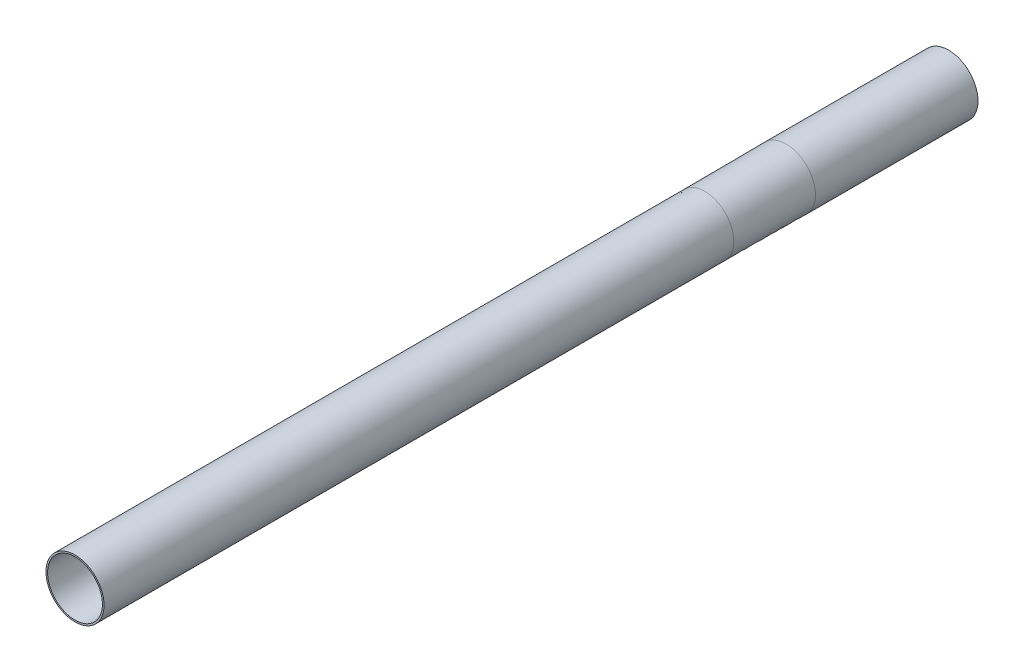
ISO-10303-21;
HEADER;
FILE_DESCRIPTION(('STEP AP214'),'2;1');
FILE_NAME('part.step','',(''),(''),'','','');
FILE_SCHEMA(('AUTOMOTIVE_DESIGN { 1 0 10303 214 1 1 1 1 }'));
ENDSEC;
DATA;
#1=APPLICATION_CONTEXT('core data for automotive mechanical design processes');
#2=APPLICATION_PROTOCOL_DEFINITION('international standard','automotive_design',2000,#1);
#3=PRODUCT_CONTEXT('',#1,'mechanical');
#4=PRODUCT('Part','Part','',(#3));
#5=PRODUCT_RELATED_PRODUCT_CATEGORY('part','',(#4));
#6=PRODUCT_DEFINITION_FORMATION('','',#4);
#7=PRODUCT_DEFINITION_CONTEXT('part definition',#1,'design');
#8=PRODUCT_DEFINITION('design','',#6,#7);
#9=PRODUCT_DEFINITION_SHAPE('','',#8);
#10=(LENGTH_UNIT() NAMED_UNIT(*) SI_UNIT(.MILLI.,.METRE.));
#11=(NAMED_UNIT(*) PLANE_ANGLE_UNIT() SI_UNIT($,.RADIAN.));
#12=(NAMED_UNIT(*) SI_UNIT($,.STERADIAN.) SOLID_ANGLE_UNIT());
#13=UNCERTAINTY_MEASURE_WITH_UNIT(LENGTH_MEASURE(1.E-05),#10,'distance_accuracy_value','');
#14=(GEOMETRIC_REPRESENTATION_CONTEXT(3) GLOBAL_UNCERTAINTY_ASSIGNED_CONTEXT((#13)) GLOBAL_UNIT_ASSIGNED_CONTEXT((#10,
#11,#12)) REPRESENTATION_CONTEXT('',''));
#15=CARTESIAN_POINT('',(0.,0.,0.));
#16=DIRECTION('',(0.,0.,1.));
#17=DIRECTION('',(1.,0.,0.));
#18=AXIS2_PLACEMENT_3D('',#15,#16,#17);
#19=CARTESIAN_POINT('',(0.,0.,310.));
#20=DIRECTION('',(0.,0.,-1.));
#21=DIRECTION('',(-1.,0.,0.));
#22=AXIS2_PLACEMENT_3D('',#19,#20,#21);
#23=CYLINDRICAL_SURFACE('',#22,13.5);
#24=CARTESIAN_POINT('',(0.,0.,310.));
#25=DIRECTION('',(0.,0.,1.));
#26=DIRECTION('',(1.,0.,0.));
#27=AXIS2_PLACEMENT_3D('',#24,#25,#26);
#28=CIRCLE('',#27,13.5);
#29=CARTESIAN_POINT('',(13.5,0.,310.));
#30=VERTEX_POINT('',#29);
#31=EDGE_CURVE('E103',#30,#30,#28,.T.);
#32=ORIENTED_EDGE('',*,*,#31,.T.);
#33=EDGE_LOOP('',(#32));
#34=FACE_BOUND('',#33,.T.);
#35=CARTESIAN_POINT('',(0.,0.,250.));
#36=DIRECTION('',(0.,0.,1.));
#37=DIRECTION('',(1.,0.,0.));
#38=AXIS2_PLACEMENT_3D('',#35,#36,#37);
#39=CIRCLE('',#38,13.5);
#40=CARTESIAN_POINT('',(13.5,0.,250.));
#41=VERTEX_POINT('',#40);
#42=EDGE_CURVE('E109',#41,#41,#39,.T.);
#43=ORIENTED_EDGE('',*,*,#42,.F.);
#44=EDGE_LOOP('',(#43));
#45=FACE_BOUND('',#44,.T.);
#46=ADVANCED_FACE('F91',(#34,#45),#23,.F.);
#47=CARTESIAN_POINT('',(0.,0.,310.));
#48=DIRECTION('',(0.,0.,1.));
#49=DIRECTION('',(1.,0.,0.));
#50=AXIS2_PLACEMENT_3D('',#47,#48,#49);
#51=PLANE('',#50);
#52=CARTESIAN_POINT('',(0.,0.,310.));
#53=DIRECTION('',(0.,0.,1.));
#54=DIRECTION('',(1.,0.,0.));
#55=AXIS2_PLACEMENT_3D('',#52,#53,#54);
#56=CIRCLE('',#55,14.3);
#57=CARTESIAN_POINT('',(14.3,0.,310.));
#58=VERTEX_POINT('',#57);
#59=EDGE_CURVE('E12',#58,#58,#56,.T.);
#60=ORIENTED_EDGE('',*,*,#59,.T.);
#61=EDGE_LOOP('',(#60));
#62=FACE_BOUND('',#61,.T.);
#63=ORIENTED_EDGE('',*,*,#31,.F.);
#64=EDGE_LOOP('',(#63));
#65=FACE_BOUND('',#64,.T.);
#66=ADVANCED_FACE('F131',(#62,#65),#51,.T.);
#67=CARTESIAN_POINT('',(0.,0.,310.));
#68=DIRECTION('',(0.,0.,-1.));
#69=DIRECTION('',(-1.,0.,0.));
#70=AXIS2_PLACEMENT_3D('',#67,#68,#69);
#71=CYLINDRICAL_SURFACE('',#70,14.3);
#72=ORIENTED_EDGE('',*,*,#59,.F.);
#73=EDGE_LOOP('',(#72));
#74=FACE_BOUND('',#73,.T.);
#75=CARTESIAN_POINT('',(0.,0.,0.));
#76=DIRECTION('',(0.,0.,1.));
#77=DIRECTION('',(1.,0.,0.));
#78=AXIS2_PLACEMENT_3D('',#75,#76,#77);
#79=CIRCLE('',#78,14.3);
#80=CARTESIAN_POINT('',(14.3,0.,0.));
#81=VERTEX_POINT('',#80);
#82=EDGE_CURVE('E152',#81,#81,#79,.T.);
#83=ORIENTED_EDGE('',*,*,#82,.T.);
#84=EDGE_LOOP('',(#83));
#85=FACE_BOUND('',#84,.T.);
#86=ADVANCED_FACE('F93',(#74,#85),#71,.T.);
#87=CARTESIAN_POINT('',(13.5,0.,250.));
#88=CARTESIAN_POINT('',(13.5666666666667,0.,236.666666666667));
#89=CARTESIAN_POINT('',(13.6333333333333,0.,223.333333333333));
#90=CARTESIAN_POINT('',(13.7,0.,210.));
#91=CARTESIAN_POINT('',(13.5,-0.372542631698093,250.));
#92=CARTESIAN_POINT('',(13.5666666666667,-0.374382348397837,236.666666666667));
#93=CARTESIAN_POINT('',(13.6333333333333,-0.37622206509758,223.333333333333));
#94=CARTESIAN_POINT('',(13.7,-0.378061781797324,210.));
#95=CARTESIAN_POINT('',(13.4697542631698,-1.11061936875466,250.));
#96=CARTESIAN_POINT('',(13.5362715681731,-1.11610390884727,236.666666666667));
#97=CARTESIAN_POINT('',(13.6027888731764,-1.12158844893989,223.333333333333));
#98=CARTESIAN_POINT('',(13.6693061781797,-1.1270729890325,210.));
#99=CARTESIAN_POINT('',(13.3371340290075,-2.19322331374707,250.));
#100=CARTESIAN_POINT('',(13.4029964192742,-2.20405404616063,236.666666666667));
#101=CARTESIAN_POINT('',(13.4688588095409,-2.2148847785742,223.333333333333));
#102=CARTESIAN_POINT('',(13.5347211998076,-2.22571551098777,210.));
#103=CARTESIAN_POINT('',(13.1207477475019,-3.24783051657345,250.));
#104=CARTESIAN_POINT('',(13.1855415635389,-3.2638691857911,236.666666666667));
#105=CARTESIAN_POINT('',(13.250335379576,-3.27990785500875,223.333333333333));
#106=CARTESIAN_POINT('',(13.315129195613,-3.29594652422639,210.));
#107=CARTESIAN_POINT('',(11.3407472638489,-9.38657979109406,250.));
#108=CARTESIAN_POINT('',(11.3967509540408,-9.43293327154391,236.666666666667));
#109=CARTESIAN_POINT('',(11.4527546442326,-9.47928675199376,223.333333333333));
#110=CARTESIAN_POINT('',(11.5087583344245,-9.52564023244361,210.));
#111=CARTESIAN_POINT('',(5.96068210716948,-13.5,250.));
#112=CARTESIAN_POINT('',(5.99011757436538,-13.5666666666667,236.666666666667));
#113=CARTESIAN_POINT('',(6.01955304156127,-13.6333333333333,223.333333333333));
#114=CARTESIAN_POINT('',(6.04898850875717,-13.7,210.));
#115=CARTESIAN_POINT('',(-7.45085263396185,-13.5,250.));
#116=CARTESIAN_POINT('',(-7.48764696795673,-13.5666666666667,236.666666666667));
#117=CARTESIAN_POINT('',(-7.5244413019516,-13.6333333333333,223.333333333333));
#118=CARTESIAN_POINT('',(-7.56123563594647,-13.7,210.));
#119=CARTESIAN_POINT('',(-13.5,-7.45085263396185,250.));
#120=CARTESIAN_POINT('',(-13.5666666666667,-7.48764696795672,236.666666666667));
#121=CARTESIAN_POINT('',(-13.6333333333333,-7.5244413019516,223.333333333333));
#122=CARTESIAN_POINT('',(-13.7,-7.56123563594647,210.));
#123=CARTESIAN_POINT('',(-13.5,7.45085263396185,250.));
#124=CARTESIAN_POINT('',(-13.5666666666667,7.48764696795673,236.666666666667));
#125=CARTESIAN_POINT('',(-13.6333333333333,7.5244413019516,223.333333333333));
#126=CARTESIAN_POINT('',(-13.7,7.56123563594647,210.));
#127=CARTESIAN_POINT('',(-7.45085263396185,13.5,250.));
#128=CARTESIAN_POINT('',(-7.48764696795673,13.5666666666667,236.666666666667));
#129=CARTESIAN_POINT('',(-7.5244413019516,13.6333333333333,223.333333333333));
#130=CARTESIAN_POINT('',(-7.56123563594647,13.7,210.));
#131=CARTESIAN_POINT('',(5.96068210716948,13.5,250.));
#132=CARTESIAN_POINT('',(5.99011757436538,13.5666666666667,236.666666666667));
#133=CARTESIAN_POINT('',(6.01955304156128,13.6333333333333,223.333333333333));
#134=CARTESIAN_POINT('',(6.04898850875718,13.7,210.));
#135=CARTESIAN_POINT('',(11.3407472638489,9.38657979109406,250.));
#136=CARTESIAN_POINT('',(11.3967509540408,9.43293327154391,236.666666666667));
#137=CARTESIAN_POINT('',(11.4527546442326,9.47928675199376,223.333333333333));
#138=CARTESIAN_POINT('',(11.5087583344245,9.5256402324436,210.));
#139=CARTESIAN_POINT('',(13.1207477475019,3.24783051657345,250.));
#140=CARTESIAN_POINT('',(13.1855415635389,3.2638691857911,236.666666666667));
#141=CARTESIAN_POINT('',(13.250335379576,3.27990785500874,223.333333333333));
#142=CARTESIAN_POINT('',(13.315129195613,3.29594652422639,210.));
#143=CARTESIAN_POINT('',(13.3371340290075,2.19322331374706,250.));
#144=CARTESIAN_POINT('',(13.4029964192742,2.20405404616063,236.666666666667));
#145=CARTESIAN_POINT('',(13.4688588095409,2.2148847785742,223.333333333333));
#146=CARTESIAN_POINT('',(13.5347211998076,2.22571551098776,210.));
#147=CARTESIAN_POINT('',(13.4697542631698,1.11061936875466,250.));
#148=CARTESIAN_POINT('',(13.5362715681731,1.11610390884727,236.666666666667));
#149=CARTESIAN_POINT('',(13.6027888731764,1.12158844893989,223.333333333333));
#150=CARTESIAN_POINT('',(13.6693061781797,1.1270729890325,210.));
#151=CARTESIAN_POINT('',(13.5,0.37254263169809,250.));
#152=CARTESIAN_POINT('',(13.5666666666667,0.374382348397833,236.666666666667));
#153=CARTESIAN_POINT('',(13.6333333333333,0.376222065097577,223.333333333333));
#154=CARTESIAN_POINT('',(13.7,0.378061781797321,210.));
#155=CARTESIAN_POINT('',(13.5,0.,250.));
#156=CARTESIAN_POINT('',(13.5666666666667,0.,236.666666666667));
#157=CARTESIAN_POINT('',(13.6333333333333,0.,223.333333333333));
#158=CARTESIAN_POINT('',(13.7,0.,210.));
#159=B_SPLINE_SURFACE_WITH_KNOTS('',3,3,((#87,#88,#89,#90),(#91,#92,#93,#94),(#95,#96,#97,#98),
(#99,#100,#101,#102),(#103,#104,#105,#106),(#107,#108,#109,#110),(#111,#112,#113,#114),(#115,
#116,#117,#118),(#119,#120,#121,#122),(#123,#124,#125,#126),(#127,#128,#129,#130),(#131,#132,
#133,#134),(#135,#136,#137,#138),(#139,#140,#141,#142),(#143,#144,#145,#146),(#147,#148,#149,
#150),(#151,#152,#153,#154),(#155,#156,#157,#158)),.UNSPECIFIED.,.T.,.F.,.F.,(4,1,1,1,1,2,2,2,1,
1,1,1,4),(4,4),(0.,0.0125,0.0249999999999999,0.0375000000000001,0.05,0.25,0.5,0.75,0.95,0.9625,
0.975,0.9875,1.),(0.,1.),.UNSPECIFIED.);
#160=CARTESIAN_POINT('',(13.7,0.,210.));
#161=CARTESIAN_POINT('',(13.7,-0.378061781797324,210.));
#162=CARTESIAN_POINT('',(13.6693061781797,-1.1270729890325,210.));
#163=CARTESIAN_POINT('',(13.5347211998076,-2.22571551098777,210.));
#164=CARTESIAN_POINT('',(13.315129195613,-3.29594652422639,210.));
#165=CARTESIAN_POINT('',(11.5087583344245,-9.52564023244361,210.));
#166=CARTESIAN_POINT('',(6.04898850875717,-13.7,210.));
#167=CARTESIAN_POINT('',(-7.56123563594647,-13.7,210.));
#168=CARTESIAN_POINT('',(-13.7,-7.56123563594647,210.));
#169=CARTESIAN_POINT('',(-13.7,7.56123563594647,210.));
#170=CARTESIAN_POINT('',(-7.56123563594647,13.7,210.));
#171=CARTESIAN_POINT('',(6.04898850875718,13.7,210.));
#172=CARTESIAN_POINT('',(11.5087583344245,9.5256402324436,210.));
#173=CARTESIAN_POINT('',(13.315129195613,3.29594652422639,210.));
#174=CARTESIAN_POINT('',(13.5347211998076,2.22571551098776,210.));
#175=CARTESIAN_POINT('',(13.6693061781797,1.1270729890325,210.));
#176=CARTESIAN_POINT('',(13.7,0.378061781797321,210.));
#177=CARTESIAN_POINT('',(13.7,0.,210.));
#178=B_SPLINE_CURVE_WITH_KNOTS('',3,(#160,#161,#162,#163,#164,#165,#166,#167,#168,#169,#170,
#171,#172,#173,#174,#175,#176,#177),.UNSPECIFIED.,.T.,.F.,(4,1,1,1,1,2,2,2,1,1,1,1,4),(0.,
0.0125,0.0249999999999999,0.0375000000000001,0.05,0.25,0.5,0.75,0.95,0.9625,0.975,0.9875,1.),.UNSPECIFIED.);
#179=CARTESIAN_POINT('',(13.7,0.,210.));
#180=VERTEX_POINT('',#179);
#181=EDGE_CURVE('E157',#180,#180,#178,.F.);
#182=ORIENTED_EDGE('',*,*,#42,.T.);
#183=EDGE_LOOP('',(#182));
#184=FACE_BOUND('',#183,.T.);
#185=ORIENTED_EDGE('',*,*,#181,.F.);
#186=EDGE_LOOP('',(#185));
#187=FACE_BOUND('',#186,.T.);
#188=ADVANCED_FACE('F133',(#184,#187),#159,.F.);
#189=CARTESIAN_POINT('',(14.3,0.,0.));
#190=CARTESIAN_POINT('',(14.3666666666667,0.,-13.3333333333333));
#191=CARTESIAN_POINT('',(14.4333333333333,0.,-26.6666666666667));
#192=CARTESIAN_POINT('',(14.5,0.,-40.));
#193=CARTESIAN_POINT('',(14.3,-0.394619232095019,0.));
#194=CARTESIAN_POINT('',(14.3666666666667,-0.396458948794759,-13.3333333333333));
#195=CARTESIAN_POINT('',(14.4333333333333,-0.3982986654945,-26.6666666666667));
#196=CARTESIAN_POINT('',(14.5,-0.400138382194241,-40.));
#197=CARTESIAN_POINT('',(14.2679619232095,-1.17643384986605,0.));
#198=CARTESIAN_POINT('',(14.3344792282128,-1.18191838995866,-13.3333333333333));
#199=CARTESIAN_POINT('',(14.4009965332161,-1.18740293005127,-26.6666666666667));
#200=CARTESIAN_POINT('',(14.4675138382194,-1.19288747014388,-40.));
#201=CARTESIAN_POINT('',(14.127482712208,-2.32319210270986,0.));
#202=CARTESIAN_POINT('',(14.1933451024747,-2.33402283512342,-13.3333333333333));
#203=CARTESIAN_POINT('',(14.2592074927414,-2.34485356753699,-26.6666666666667));
#204=CARTESIAN_POINT('',(14.3250698830081,-2.35568429995055,-40.));
#205=CARTESIAN_POINT('',(13.8982735399464,-3.44029454718521,0.));
#206=CARTESIAN_POINT('',(13.9630673559835,-3.45633321640286,-13.3333333333333));
#207=CARTESIAN_POINT('',(14.0278611720205,-3.4723718856205,-26.6666666666667));
#208=CARTESIAN_POINT('',(14.0926549880576,-3.48841055483815,-40.));
#209=CARTESIAN_POINT('',(12.0127915461511,-9.94282155649223,0.));
#210=CARTESIAN_POINT('',(12.0687952363429,-9.98917503694208,-13.3333333333333));
#211=CARTESIAN_POINT('',(12.1247989265348,-10.0355285173919,-26.6666666666667));
#212=CARTESIAN_POINT('',(12.1808026167266,-10.0818819978418,-40.));
#213=CARTESIAN_POINT('',(6.31390771352026,-14.3,0.));
#214=CARTESIAN_POINT('',(6.34334318071616,-14.3666666666667,-13.3333333333333));
#215=CARTESIAN_POINT('',(6.37277864791206,-14.4333333333333,-26.6666666666667));
#216=CARTESIAN_POINT('',(6.40221411510796,-14.5,-40.));
#217=CARTESIAN_POINT('',(-7.89238464190034,-14.3,0.));
#218=CARTESIAN_POINT('',(-7.92917897589521,-14.3666666666667,-13.3333333333333));
#219=CARTESIAN_POINT('',(-7.96597330989008,-14.4333333333333,-26.6666666666667));
#220=CARTESIAN_POINT('',(-8.00276764388495,-14.5,-40.));
#221=CARTESIAN_POINT('',(-14.3,-7.89238464190033,0.));
#222=CARTESIAN_POINT('',(-14.3666666666667,-7.9291789758952,-13.3333333333333));
#223=CARTESIAN_POINT('',(-14.4333333333333,-7.96597330989008,-26.6666666666667));
#224=CARTESIAN_POINT('',(-14.5,-8.00276764388495,-40.));
#225=CARTESIAN_POINT('',(-14.3,7.89238464190034,0.));
#226=CARTESIAN_POINT('',(-14.3666666666667,7.92917897589521,-13.3333333333333));
#227=CARTESIAN_POINT('',(-14.4333333333333,7.96597330989008,-26.6666666666667));
#228=CARTESIAN_POINT('',(-14.5,8.00276764388495,-40.));
#229=CARTESIAN_POINT('',(-7.89238464190033,14.3,0.));
#230=CARTESIAN_POINT('',(-7.9291789758952,14.3666666666667,-13.3333333333333));
#231=CARTESIAN_POINT('',(-7.96597330989008,14.4333333333333,-26.6666666666667));
#232=CARTESIAN_POINT('',(-8.00276764388495,14.5,-40.));
#233=CARTESIAN_POINT('',(6.31390771352027,14.3,0.));
#234=CARTESIAN_POINT('',(6.34334318071616,14.3666666666667,-13.3333333333333));
#235=CARTESIAN_POINT('',(6.37277864791206,14.4333333333333,-26.6666666666667));
#236=CARTESIAN_POINT('',(6.40221411510796,14.5,-40.));
#237=CARTESIAN_POINT('',(12.0127915461511,9.94282155649223,0.));
#238=CARTESIAN_POINT('',(12.0687952363429,9.98917503694208,-13.3333333333333));
#239=CARTESIAN_POINT('',(12.1247989265348,10.0355285173919,-26.6666666666667));
#240=CARTESIAN_POINT('',(12.1808026167266,10.0818819978418,-40.));
#241=CARTESIAN_POINT('',(13.8982735399464,3.44029454718521,0.));
#242=CARTESIAN_POINT('',(13.9630673559835,3.45633321640286,-13.3333333333333));
#243=CARTESIAN_POINT('',(14.0278611720205,3.47237188562051,-26.6666666666667));
#244=CARTESIAN_POINT('',(14.0926549880576,3.48841055483816,-40.));
#245=CARTESIAN_POINT('',(14.127482712208,2.32319210270985,0.));
#246=CARTESIAN_POINT('',(14.1933451024747,2.33402283512342,-13.3333333333333));
#247=CARTESIAN_POINT('',(14.2592074927414,2.34485356753699,-26.6666666666667));
#248=CARTESIAN_POINT('',(14.3250698830081,2.35568429995056,-40.));
#249=CARTESIAN_POINT('',(14.2679619232095,1.17643384986604,0.));
#250=CARTESIAN_POINT('',(14.3344792282128,1.18191838995866,-13.3333333333333));
#251=CARTESIAN_POINT('',(14.4009965332161,1.18740293005128,-26.6666666666667));
#252=CARTESIAN_POINT('',(14.4675138382194,1.1928874701439,-40.));
#253=CARTESIAN_POINT('',(14.3,0.394619232095012,0.));
#254=CARTESIAN_POINT('',(14.3666666666667,0.396458948794758,-13.3333333333333));
#255=CARTESIAN_POINT('',(14.4333333333333,0.398298665494505,-26.6666666666667));
#256=CARTESIAN_POINT('',(14.5,0.400138382194251,-40.));
#257=CARTESIAN_POINT('',(14.3,0.,0.));
#258=CARTESIAN_POINT('',(14.3666666666667,0.,-13.3333333333333));
#259=CARTESIAN_POINT('',(14.4333333333333,0.,-26.6666666666667));
#260=CARTESIAN_POINT('',(14.5,0.,-40.));
#261=B_SPLINE_SURFACE_WITH_KNOTS('',3,3,((#189,#190,#191,#192),(#193,#194,#195,#196),(#197,#198,
#199,#200),(#201,#202,#203,#204),(#205,#206,#207,#208),(#209,#210,#211,#212),(#213,#214,#215,
#216),(#217,#218,#219,#220),(#221,#222,#223,#224),(#225,#226,#227,#228),(#229,#230,#231,#232),
(#233,#234,#235,#236),(#237,#238,#239,#240),(#241,#242,#243,#244),(#245,#246,#247,#248),(#249,
#250,#251,#252),(#253,#254,#255,#256),(#257,#258,#259,#260)),.UNSPECIFIED.,.T.,.F.,.F.,(4,1,1,1,
1,2,2,2,1,1,1,1,4),(4,4),(0.,0.0125,0.0249999999999999,0.0375000000000001,0.05,0.25,0.5,0.75,
0.95,0.9625,0.975,0.9875,1.),(0.,1.),.UNSPECIFIED.);
#262=CARTESIAN_POINT('',(0.,0.,-40.));
#263=DIRECTION('',(0.,0.,-1.));
#264=DIRECTION('',(-1.,0.,0.));
#265=AXIS2_PLACEMENT_3D('',#262,#263,#264);
#266=CIRCLE('',#265,14.5);
#267=CARTESIAN_POINT('',(14.5,0.,-40.));
#268=VERTEX_POINT('',#267);
#269=EDGE_CURVE('E156',#268,#268,#266,.T.);
#270=CARTESIAN_POINT('',(14.3,0.,0.));
#271=CARTESIAN_POINT('',(14.3020833333333,0.,-0.416666666666667));
#272=CARTESIAN_POINT('',(14.3041666666667,0.,-0.833333333333333));
#273=CARTESIAN_POINT('',(14.3083333333333,0.,-1.66666666666667));
#274=CARTESIAN_POINT('',(14.3104166666667,0.,-2.08333333333333));
#275=CARTESIAN_POINT('',(14.3145833333333,0.,-2.91666666666667));
#276=CARTESIAN_POINT('',(14.3166666666667,0.,-3.33333333333333));
#277=CARTESIAN_POINT('',(14.3208333333333,0.,-4.16666666666667));
#278=CARTESIAN_POINT('',(14.3229166666667,0.,-4.58333333333333));
#279=CARTESIAN_POINT('',(14.3270833333333,0.,-5.41666666666667));
#280=CARTESIAN_POINT('',(14.3291666666667,0.,-5.83333333333333));
#281=CARTESIAN_POINT('',(14.3333333333333,0.,-6.66666666666667));
#282=CARTESIAN_POINT('',(14.3354166666667,0.,-7.08333333333333));
#283=CARTESIAN_POINT('',(14.3395833333333,0.,-7.91666666666667));
#284=CARTESIAN_POINT('',(14.3416666666667,0.,-8.33333333333333));
#285=CARTESIAN_POINT('',(14.3458333333333,0.,-9.16666666666666));
#286=CARTESIAN_POINT('',(14.3479166666667,0.,-9.58333333333333));
#287=CARTESIAN_POINT('',(14.3520833333333,0.,-10.4166666666667));
#288=CARTESIAN_POINT('',(14.3541666666667,0.,-10.8333333333333));
#289=CARTESIAN_POINT('',(14.3583333333333,0.,-11.6666666666667));
#290=CARTESIAN_POINT('',(14.3604166666667,0.,-12.0833333333333));
#291=CARTESIAN_POINT('',(14.3645833333333,0.,-12.9166666666667));
#292=CARTESIAN_POINT('',(14.3666666666667,0.,-13.3333333333333));
#293=CARTESIAN_POINT('',(14.3708333333333,0.,-14.1666666666667));
#294=CARTESIAN_POINT('',(14.3729166666667,0.,-14.5833333333333));
#295=CARTESIAN_POINT('',(14.3770833333333,0.,-15.4166666666667));
#296=CARTESIAN_POINT('',(14.3791666666667,0.,-15.8333333333333));
#297=CARTESIAN_POINT('',(14.3833333333333,0.,-16.6666666666667));
#298=CARTESIAN_POINT('',(14.3854166666667,0.,-17.0833333333333));
#299=CARTESIAN_POINT('',(14.3895833333333,0.,-17.9166666666667));
#300=CARTESIAN_POINT('',(14.3916666666667,0.,-18.3333333333333));
#301=CARTESIAN_POINT('',(14.3958333333333,0.,-19.1666666666667));
#302=CARTESIAN_POINT('',(14.3979166666667,0.,-19.5833333333333));
#303=CARTESIAN_POINT('',(14.4020833333333,0.,-20.4166666666667));
#304=CARTESIAN_POINT('',(14.4041666666667,0.,-20.8333333333333));
#305=CARTESIAN_POINT('',(14.4083333333333,0.,-21.6666666666667));
#306=CARTESIAN_POINT('',(14.4104166666667,0.,-22.0833333333333));
#307=CARTESIAN_POINT('',(14.4145833333333,0.,-22.9166666666667));
#308=CARTESIAN_POINT('',(14.4166666666667,0.,-23.3333333333333));
#309=CARTESIAN_POINT('',(14.4208333333333,0.,-24.1666666666667));
#310=CARTESIAN_POINT('',(14.4229166666667,0.,-24.5833333333333));
#311=CARTESIAN_POINT('',(14.4270833333333,0.,-25.4166666666667));
#312=CARTESIAN_POINT('',(14.4291666666667,0.,-25.8333333333333));
#313=CARTESIAN_POINT('',(14.4333333333333,0.,-26.6666666666667));
#314=CARTESIAN_POINT('',(14.4354166666667,0.,-27.0833333333333));
#315=CARTESIAN_POINT('',(14.4395833333333,0.,-27.9166666666667));
#316=CARTESIAN_POINT('',(14.4416666666667,0.,-28.3333333333333));
#317=CARTESIAN_POINT('',(14.4458333333333,0.,-29.1666666666667));
#318=CARTESIAN_POINT('',(14.4479166666667,0.,-29.5833333333333));
#319=CARTESIAN_POINT('',(14.4520833333333,0.,-30.4166666666667));
#320=CARTESIAN_POINT('',(14.4541666666667,0.,-30.8333333333333));
#321=CARTESIAN_POINT('',(14.4583333333333,0.,-31.6666666666667));
#322=CARTESIAN_POINT('',(14.4604166666667,0.,-32.0833333333333));
#323=CARTESIAN_POINT('',(14.4645833333333,0.,-32.9166666666667));
#324=CARTESIAN_POINT('',(14.4666666666667,0.,-33.3333333333333));
#325=CARTESIAN_POINT('',(14.4708333333333,0.,-34.1666666666667));
#326=CARTESIAN_POINT('',(14.4729166666667,0.,-34.5833333333333));
#327=CARTESIAN_POINT('',(14.4770833333333,0.,-35.4166666666667));
#328=CARTESIAN_POINT('',(14.4791666666667,0.,-35.8333333333333));
#329=CARTESIAN_POINT('',(14.4833333333333,0.,-36.6666666666667));
#330=CARTESIAN_POINT('',(14.4854166666667,0.,-37.0833333333333));
#331=CARTESIAN_POINT('',(14.4895833333333,0.,-37.9166666666667));
#332=CARTESIAN_POINT('',(14.4916666666667,0.,-38.3333333333333));
#333=CARTESIAN_POINT('',(14.4958333333333,0.,-39.1666666666667));
#334=CARTESIAN_POINT('',(14.4979166666667,0.,-39.5833333333333));
#335=CARTESIAN_POINT('',(14.5,0.,-40.));
#336=B_SPLINE_CURVE_WITH_KNOTS('',3,(#270,#271,#272,#273,#274,#275,#276,#277,#278,#279,#280,
#281,#282,#283,#284,#285,#286,#287,#288,#289,#290,#291,#292,#293,#294,#295,#296,#297,#298,#299,
#300,#301,#302,#303,#304,#305,#306,#307,#308,#309,#310,#311,#312,#313,#314,#315,#316,#317,#318,
#319,#320,#321,#322,#323,#324,#325,#326,#327,#328,#329,#330,#331,#332,#333,#334,#335),
.UNSPECIFIED.,.F.,.F.,(4,2,2,2,2,2,2,2,2,2,2,2,2,2,2,2,2,2,2,2,2,2,2,2,2,2,2,2,2,2,2,2,4),(0.,
1.25001562490235,2.50003124980469,3.75004687470704,5.00006249960938,6.25007812451172,
7.50009374941407,8.75010937431641,10.0001249992188,11.2501406241211,12.5001562490234,
13.7501718739258,15.0001874988281,16.2502031237305,17.5002187486328,18.7502343735352,
20.0002499984375,21.2502656233399,22.5002812482422,23.7502968731445,25.0003124980469,
26.2503281229492,27.5003437478516,28.7503593727539,30.0003749976563,31.2503906225586,
32.500406247461,33.7504218723633,35.0004374972657,36.250453122168,37.5004687470703,
38.7504843719727,40.000499996875),.UNSPECIFIED.);
#337=EDGE_CURVE('BSEAM148',#81,#268,#336,.T.);
#338=ORIENTED_EDGE('',*,*,#82,.F.);
#339=ORIENTED_EDGE('',*,*,#269,.F.);
#340=ORIENTED_EDGE('',*,*,#337,.T.);
#341=ORIENTED_EDGE('',*,*,#337,.F.);
#342=EDGE_LOOP('',(#338,#340,#339,#341));
#343=FACE_BOUND('',#342,.T.);
#344=ADVANCED_FACE('F148',(#343),#261,.T.);
#345=CARTESIAN_POINT('',(0.,0.,-40.0365402607069));
#346=DIRECTION('',(0.,0.,1.));
#347=DIRECTION('',(1.,0.,0.));
#348=AXIS2_PLACEMENT_3D('',#345,#346,#347);
#349=CYLINDRICAL_SURFACE('',#348,13.7);
#350=ORIENTED_EDGE('',*,*,#181,.T.);
#351=EDGE_LOOP('',(#350));
#352=FACE_BOUND('',#351,.T.);
#353=CARTESIAN_POINT('',(0.,0.,-120.));
#354=DIRECTION('',(0.,0.,-1.));
#355=DIRECTION('',(-1.,0.,0.));
#356=AXIS2_PLACEMENT_3D('',#353,#354,#355);
#357=CIRCLE('',#356,13.7);
#358=CARTESIAN_POINT('',(-13.7,0.,-120.));
#359=VERTEX_POINT('',#358);
#360=EDGE_CURVE('E210',#359,#359,#357,.T.);
#361=ORIENTED_EDGE('',*,*,#360,.T.);
#362=EDGE_LOOP('',(#361));
#363=FACE_BOUND('',#362,.T.);
#364=ADVANCED_FACE('F197',(#352,#363),#349,.F.);
#365=CARTESIAN_POINT('',(0.,0.,-120.));
#366=DIRECTION('',(0.,0.,-1.));
#367=DIRECTION('',(-1.,0.,0.));
#368=AXIS2_PLACEMENT_3D('',#365,#366,#367);
#369=PLANE('',#368);
#370=CARTESIAN_POINT('',(0.,0.,-120.));
#371=DIRECTION('',(0.,0.,-1.));
#372=DIRECTION('',(-1.,0.,0.));
#373=AXIS2_PLACEMENT_3D('',#370,#371,#372);
#374=CIRCLE('',#373,14.5);
#375=CARTESIAN_POINT('',(-14.5,0.,-120.));
#376=VERTEX_POINT('',#375);
#377=EDGE_CURVE('E164',#376,#376,#374,.T.);
#378=ORIENTED_EDGE('',*,*,#377,.T.);
#379=EDGE_LOOP('',(#378));
#380=FACE_BOUND('',#379,.T.);
#381=ORIENTED_EDGE('',*,*,#360,.F.);
#382=EDGE_LOOP('',(#381));
#383=FACE_BOUND('',#382,.T.);
#384=ADVANCED_FACE('F207',(#380,#383),#369,.T.);
#385=CARTESIAN_POINT('',(0.,0.,-120.));
#386=DIRECTION('',(0.,0.,1.));
#387=DIRECTION('',(1.,0.,0.));
#388=AXIS2_PLACEMENT_3D('',#385,#386,#387);
#389=CYLINDRICAL_SURFACE('',#388,14.5);
#390=ORIENTED_EDGE('',*,*,#377,.F.);
#391=EDGE_LOOP('',(#390));
#392=FACE_BOUND('',#391,.T.);
#393=ORIENTED_EDGE('',*,*,#269,.T.);
#394=EDGE_LOOP('',(#393));
#395=FACE_BOUND('',#394,.T.);
#396=ADVANCED_FACE('F225',(#392,#395),#389,.T.);
#397=CLOSED_SHELL('',(#46,#66,#86,#188,#344,#364,#384,#396));
#398=MANIFOLD_SOLID_BREP('B2',#397);
#399=ADVANCED_BREP_SHAPE_REPRESENTATION('',(#18,#398),#14);
#400=SHAPE_DEFINITION_REPRESENTATION(#9,#399);
ENDSEC;
END-ISO-10303-21;
